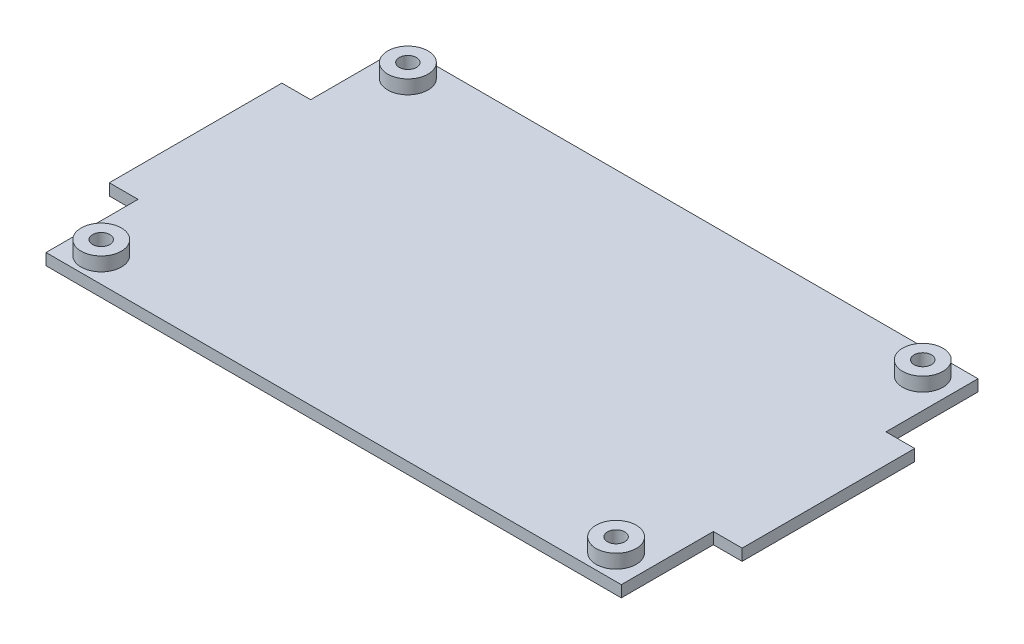
ISO-10303-21;
HEADER;
FILE_DESCRIPTION(('STEP AP214'),'2;1');
FILE_NAME('part.step','',(''),(''),'','','');
FILE_SCHEMA(('AUTOMOTIVE_DESIGN { 1 0 10303 214 1 1 1 1 }'));
ENDSEC;
DATA;
#1=APPLICATION_CONTEXT('core data for automotive mechanical design processes');
#2=APPLICATION_PROTOCOL_DEFINITION('international standard','automotive_design',2000,#1);
#3=PRODUCT_CONTEXT('',#1,'mechanical');
#4=PRODUCT('Part','Part','',(#3));
#5=PRODUCT_RELATED_PRODUCT_CATEGORY('part','',(#4));
#6=PRODUCT_DEFINITION_FORMATION('','',#4);
#7=PRODUCT_DEFINITION_CONTEXT('part definition',#1,'design');
#8=PRODUCT_DEFINITION('design','',#6,#7);
#9=PRODUCT_DEFINITION_SHAPE('','',#8);
#10=(LENGTH_UNIT() NAMED_UNIT(*) SI_UNIT(.MILLI.,.METRE.));
#11=(NAMED_UNIT(*) PLANE_ANGLE_UNIT() SI_UNIT($,.RADIAN.));
#12=(NAMED_UNIT(*) SI_UNIT($,.STERADIAN.) SOLID_ANGLE_UNIT());
#13=UNCERTAINTY_MEASURE_WITH_UNIT(LENGTH_MEASURE(1.E-05),#10,'distance_accuracy_value','');
#14=(GEOMETRIC_REPRESENTATION_CONTEXT(3) GLOBAL_UNCERTAINTY_ASSIGNED_CONTEXT((#13)) GLOBAL_UNIT_ASSIGNED_CONTEXT((#10,
#11,#12)) REPRESENTATION_CONTEXT('',''));
#15=CARTESIAN_POINT('',(0.,0.,0.));
#16=DIRECTION('',(0.,0.,1.));
#17=DIRECTION('',(1.,0.,0.));
#18=AXIS2_PLACEMENT_3D('',#15,#16,#17);
#19=CARTESIAN_POINT('',(0.,2.,0.));
#20=DIRECTION('',(0.,-1.,0.));
#21=DIRECTION('',(0.,0.,-1.));
#22=AXIS2_PLACEMENT_3D('',#19,#20,#21);
#23=PLANE('',#22);
#24=CARTESIAN_POINT('',(-44.75,2.,26.65));
#25=DIRECTION('',(0.,-1.,0.));
#26=DIRECTION('',(0.,0.,-1.));
#27=AXIS2_PLACEMENT_3D('',#24,#25,#26);
#28=CIRCLE('',#27,3.5);
#29=CARTESIAN_POINT('',(-44.75,2.,23.15));
#30=VERTEX_POINT('',#29);
#31=EDGE_CURVE('E67',#30,#30,#28,.F.);
#32=ORIENTED_EDGE('',*,*,#31,.F.);
#33=EDGE_LOOP('',(#32));
#34=FACE_BOUND('',#33,.T.);
#35=CARTESIAN_POINT('',(-44.75,2.,-26.65));
#36=DIRECTION('',(0.,-1.,0.));
#37=DIRECTION('',(0.,0.,-1.));
#38=AXIS2_PLACEMENT_3D('',#35,#36,#37);
#39=CIRCLE('',#38,3.5);
#40=CARTESIAN_POINT('',(-44.75,2.,-30.15));
#41=VERTEX_POINT('',#40);
#42=EDGE_CURVE('E161',#41,#41,#39,.F.);
#43=ORIENTED_EDGE('',*,*,#42,.F.);
#44=EDGE_LOOP('',(#43));
#45=FACE_BOUND('',#44,.T.);
#46=DIRECTION('',(1.,0.,0.));
#47=VECTOR('',#46,1.);
#48=CARTESIAN_POINT('',(-55.,2.,-15.));
#49=LINE('',#48,#47);
#50=CARTESIAN_POINT('',(50.,2.,-15.));
#51=VERTEX_POINT('',#50);
#52=CARTESIAN_POINT('',(55.,2.,-15.));
#53=VERTEX_POINT('',#52);
#54=EDGE_CURVE('E182',#51,#53,#49,.T.);
#55=ORIENTED_EDGE('',*,*,#54,.F.);
#56=DIRECTION('',(0.,0.,1.));
#57=VECTOR('',#56,1.);
#58=CARTESIAN_POINT('',(50.,2.,-31.));
#59=LINE('',#58,#57);
#60=CARTESIAN_POINT('',(50.,2.,-31.));
#61=VERTEX_POINT('',#60);
#62=EDGE_CURVE('E281',#61,#51,#59,.T.);
#63=ORIENTED_EDGE('',*,*,#62,.F.);
#64=DIRECTION('',(1.,0.,0.));
#65=VECTOR('',#64,1.);
#66=CARTESIAN_POINT('',(-50.,2.,-31.));
#67=LINE('',#66,#65);
#68=CARTESIAN_POINT('',(-50.,2.,-31.));
#69=VERTEX_POINT('',#68);
#70=EDGE_CURVE('E119',#69,#61,#67,.T.);
#71=ORIENTED_EDGE('',*,*,#70,.F.);
#72=DIRECTION('',(0.,0.,1.));
#73=VECTOR('',#72,1.);
#74=CARTESIAN_POINT('',(-50.,2.,-31.));
#75=LINE('',#74,#73);
#76=CARTESIAN_POINT('',(-50.,2.,-15.));
#77=VERTEX_POINT('',#76);
#78=EDGE_CURVE('E117',#69,#77,#75,.T.);
#79=ORIENTED_EDGE('',*,*,#78,.T.);
#80=CARTESIAN_POINT('',(-55.,2.,-15.));
#81=VERTEX_POINT('',#80);
#82=EDGE_CURVE('E320',#81,#77,#49,.T.);
#83=ORIENTED_EDGE('',*,*,#82,.F.);
#84=DIRECTION('',(0.,0.,1.));
#85=VECTOR('',#84,1.);
#86=CARTESIAN_POINT('',(-55.,2.,-15.));
#87=LINE('',#86,#85);
#88=CARTESIAN_POINT('',(-55.,2.,15.));
#89=VERTEX_POINT('',#88);
#90=EDGE_CURVE('E292',#81,#89,#87,.T.);
#91=ORIENTED_EDGE('',*,*,#90,.T.);
#92=DIRECTION('',(1.,0.,0.));
#93=VECTOR('',#92,1.);
#94=CARTESIAN_POINT('',(-55.,2.,15.));
#95=LINE('',#94,#93);
#96=CARTESIAN_POINT('',(-50.,2.,15.));
#97=VERTEX_POINT('',#96);
#98=EDGE_CURVE('E313',#89,#97,#95,.T.);
#99=ORIENTED_EDGE('',*,*,#98,.T.);
#100=CARTESIAN_POINT('',(-50.,2.,31.));
#101=VERTEX_POINT('',#100);
#102=EDGE_CURVE('E134',#97,#101,#75,.T.);
#103=ORIENTED_EDGE('',*,*,#102,.T.);
#104=DIRECTION('',(1.,0.,0.));
#105=VECTOR('',#104,1.);
#106=CARTESIAN_POINT('',(-50.,2.,31.));
#107=LINE('',#106,#105);
#108=CARTESIAN_POINT('',(50.,2.,31.));
#109=VERTEX_POINT('',#108);
#110=EDGE_CURVE('E285',#101,#109,#107,.T.);
#111=ORIENTED_EDGE('',*,*,#110,.T.);
#112=CARTESIAN_POINT('',(50.,2.,15.));
#113=VERTEX_POINT('',#112);
#114=EDGE_CURVE('E284',#113,#109,#59,.T.);
#115=ORIENTED_EDGE('',*,*,#114,.F.);
#116=CARTESIAN_POINT('',(55.,2.,15.));
#117=VERTEX_POINT('',#116);
#118=EDGE_CURVE('E316',#113,#117,#95,.T.);
#119=ORIENTED_EDGE('',*,*,#118,.T.);
#120=DIRECTION('',(0.,0.,1.));
#121=VECTOR('',#120,1.);
#122=CARTESIAN_POINT('',(55.,2.,-15.));
#123=LINE('',#122,#121);
#124=EDGE_CURVE('E317',#53,#117,#123,.T.);
#125=ORIENTED_EDGE('',*,*,#124,.F.);
#126=EDGE_LOOP('',(#55,#63,#71,#79,#83,#91,#99,#103,#111,#115,#119,#125));
#127=FACE_BOUND('',#126,.T.);
#128=CARTESIAN_POINT('',(44.75,2.,-26.65));
#129=DIRECTION('',(0.,-1.,0.));
#130=DIRECTION('',(0.,0.,-1.));
#131=AXIS2_PLACEMENT_3D('',#128,#129,#130);
#132=CIRCLE('',#131,3.5);
#133=CARTESIAN_POINT('',(44.75,2.,-30.15));
#134=VERTEX_POINT('',#133);
#135=EDGE_CURVE('E164',#134,#134,#132,.F.);
#136=ORIENTED_EDGE('',*,*,#135,.F.);
#137=EDGE_LOOP('',(#136));
#138=FACE_BOUND('',#137,.T.);
#139=CARTESIAN_POINT('',(44.75,2.,26.65));
#140=DIRECTION('',(0.,-1.,0.));
#141=DIRECTION('',(0.,0.,-1.));
#142=AXIS2_PLACEMENT_3D('',#139,#140,#141);
#143=CIRCLE('',#142,3.5);
#144=CARTESIAN_POINT('',(44.75,2.,23.15));
#145=VERTEX_POINT('',#144);
#146=EDGE_CURVE('E12',#145,#145,#143,.F.);
#147=ORIENTED_EDGE('',*,*,#146,.F.);
#148=EDGE_LOOP('',(#147));
#149=FACE_BOUND('',#148,.T.);
#150=ADVANCED_FACE('F58',(#34,#45,#127,#138,#149),#23,.F.);
#151=CARTESIAN_POINT('',(-55.,2.,15.));
#152=DIRECTION('',(0.,0.,-1.));
#153=DIRECTION('',(-1.,0.,0.));
#154=AXIS2_PLACEMENT_3D('',#151,#152,#153);
#155=PLANE('',#154);
#156=ORIENTED_EDGE('',*,*,#118,.F.);
#157=DIRECTION('',(0.,-1.,0.));
#158=VECTOR('',#157,1.);
#159=CARTESIAN_POINT('',(50.,2.,15.));
#160=LINE('',#159,#158);
#161=CARTESIAN_POINT('',(50.,0.,15.));
#162=VERTEX_POINT('',#161);
#163=EDGE_CURVE('E75',#113,#162,#160,.T.);
#164=ORIENTED_EDGE('',*,*,#163,.T.);
#165=DIRECTION('',(1.,0.,0.));
#166=VECTOR('',#165,1.);
#167=CARTESIAN_POINT('',(-55.,0.,15.));
#168=LINE('',#167,#166);
#169=CARTESIAN_POINT('',(55.,0.,15.));
#170=VERTEX_POINT('',#169);
#171=EDGE_CURVE('E306',#162,#170,#168,.T.);
#172=ORIENTED_EDGE('',*,*,#171,.T.);
#173=DIRECTION('',(0.,-1.,0.));
#174=VECTOR('',#173,1.);
#175=CARTESIAN_POINT('',(55.,2.,15.));
#176=LINE('',#175,#174);
#177=EDGE_CURVE('E291',#117,#170,#176,.T.);
#178=ORIENTED_EDGE('',*,*,#177,.F.);
#179=EDGE_LOOP('',(#156,#164,#172,#178));
#180=FACE_BOUND('',#179,.T.);
#181=ADVANCED_FACE('F173',(#180),#155,.F.);
#182=CARTESIAN_POINT('',(55.,2.,-15.));
#183=DIRECTION('',(1.,0.,0.));
#184=DIRECTION('',(0.,0.,-1.));
#185=AXIS2_PLACEMENT_3D('',#182,#183,#184);
#186=PLANE('',#185);
#187=DIRECTION('',(0.,0.,1.));
#188=VECTOR('',#187,1.);
#189=CARTESIAN_POINT('',(55.,0.,-15.));
#190=LINE('',#189,#188);
#191=CARTESIAN_POINT('',(55.,0.,-15.));
#192=VERTEX_POINT('',#191);
#193=EDGE_CURVE('E307',#192,#170,#190,.T.);
#194=ORIENTED_EDGE('',*,*,#193,.F.);
#195=DIRECTION('',(0.,-1.,0.));
#196=VECTOR('',#195,1.);
#197=CARTESIAN_POINT('',(55.,2.,-15.));
#198=LINE('',#197,#196);
#199=EDGE_CURVE('E288',#53,#192,#198,.T.);
#200=ORIENTED_EDGE('',*,*,#199,.F.);
#201=ORIENTED_EDGE('',*,*,#124,.T.);
#202=ORIENTED_EDGE('',*,*,#177,.T.);
#203=EDGE_LOOP('',(#194,#200,#201,#202));
#204=FACE_BOUND('',#203,.T.);
#205=ADVANCED_FACE('F249',(#204),#186,.T.);
#206=CARTESIAN_POINT('',(-55.,2.,-15.));
#207=DIRECTION('',(0.,0.,-1.));
#208=DIRECTION('',(-1.,0.,0.));
#209=AXIS2_PLACEMENT_3D('',#206,#207,#208);
#210=PLANE('',#209);
#211=DIRECTION('',(0.,-1.,0.));
#212=VECTOR('',#211,1.);
#213=CARTESIAN_POINT('',(50.,2.,-15.));
#214=LINE('',#213,#212);
#215=CARTESIAN_POINT('',(50.,0.,-15.));
#216=VERTEX_POINT('',#215);
#217=EDGE_CURVE('E153',#51,#216,#214,.T.);
#218=ORIENTED_EDGE('',*,*,#217,.F.);
#219=ORIENTED_EDGE('',*,*,#54,.T.);
#220=ORIENTED_EDGE('',*,*,#199,.T.);
#221=DIRECTION('',(1.,0.,0.));
#222=VECTOR('',#221,1.);
#223=CARTESIAN_POINT('',(-55.,0.,-15.));
#224=LINE('',#223,#222);
#225=EDGE_CURVE('E149',#216,#192,#224,.T.);
#226=ORIENTED_EDGE('',*,*,#225,.F.);
#227=EDGE_LOOP('',(#218,#219,#220,#226));
#228=FACE_BOUND('',#227,.T.);
#229=ADVANCED_FACE('F241',(#228),#210,.T.);
#230=CARTESIAN_POINT('',(0.,0.,0.));
#231=DIRECTION('',(0.,-1.,0.));
#232=DIRECTION('',(0.,0.,-1.));
#233=AXIS2_PLACEMENT_3D('',#230,#231,#232);
#234=PLANE('',#233);
#235=CARTESIAN_POINT('',(-44.75,0.,26.65));
#236=DIRECTION('',(0.,1.,0.));
#237=DIRECTION('',(0.,0.,1.));
#238=AXIS2_PLACEMENT_3D('',#235,#236,#237);
#239=CIRCLE('',#238,1.5);
#240=CARTESIAN_POINT('',(-44.75,0.,28.15));
#241=VERTEX_POINT('',#240);
#242=EDGE_CURVE('E326',#241,#241,#239,.T.);
#243=ORIENTED_EDGE('',*,*,#242,.T.);
#244=EDGE_LOOP('',(#243));
#245=FACE_BOUND('',#244,.T.);
#246=CARTESIAN_POINT('',(44.75,0.,26.65));
#247=DIRECTION('',(0.,1.,0.));
#248=DIRECTION('',(0.,0.,1.));
#249=AXIS2_PLACEMENT_3D('',#246,#247,#248);
#250=CIRCLE('',#249,1.5);
#251=CARTESIAN_POINT('',(44.75,0.,28.15));
#252=VERTEX_POINT('',#251);
#253=EDGE_CURVE('E330',#252,#252,#250,.T.);
#254=ORIENTED_EDGE('',*,*,#253,.T.);
#255=EDGE_LOOP('',(#254));
#256=FACE_BOUND('',#255,.T.);
#257=CARTESIAN_POINT('',(44.75,0.,-26.65));
#258=DIRECTION('',(0.,1.,0.));
#259=DIRECTION('',(0.,0.,1.));
#260=AXIS2_PLACEMENT_3D('',#257,#258,#259);
#261=CIRCLE('',#260,1.5);
#262=CARTESIAN_POINT('',(44.75,0.,-25.15));
#263=VERTEX_POINT('',#262);
#264=EDGE_CURVE('E327',#263,#263,#261,.T.);
#265=ORIENTED_EDGE('',*,*,#264,.T.);
#266=EDGE_LOOP('',(#265));
#267=FACE_BOUND('',#266,.T.);
#268=CARTESIAN_POINT('',(-44.75,0.,-26.65));
#269=DIRECTION('',(0.,1.,0.));
#270=DIRECTION('',(0.,0.,1.));
#271=AXIS2_PLACEMENT_3D('',#268,#269,#270);
#272=CIRCLE('',#271,1.5);
#273=CARTESIAN_POINT('',(-44.75,0.,-25.15));
#274=VERTEX_POINT('',#273);
#275=EDGE_CURVE('E323',#274,#274,#272,.T.);
#276=ORIENTED_EDGE('',*,*,#275,.T.);
#277=EDGE_LOOP('',(#276));
#278=FACE_BOUND('',#277,.T.);
#279=ORIENTED_EDGE('',*,*,#171,.F.);
#280=DIRECTION('',(0.,0.,1.));
#281=VECTOR('',#280,1.);
#282=CARTESIAN_POINT('',(50.,0.,-31.));
#283=LINE('',#282,#281);
#284=CARTESIAN_POINT('',(50.,0.,31.));
#285=VERTEX_POINT('',#284);
#286=EDGE_CURVE('E138',#162,#285,#283,.T.);
#287=ORIENTED_EDGE('',*,*,#286,.T.);
#288=DIRECTION('',(1.,0.,0.));
#289=VECTOR('',#288,1.);
#290=CARTESIAN_POINT('',(-50.,0.,31.));
#291=LINE('',#290,#289);
#292=CARTESIAN_POINT('',(-50.,0.,31.));
#293=VERTEX_POINT('',#292);
#294=EDGE_CURVE('E130',#293,#285,#291,.T.);
#295=ORIENTED_EDGE('',*,*,#294,.F.);
#296=DIRECTION('',(0.,0.,1.));
#297=VECTOR('',#296,1.);
#298=CARTESIAN_POINT('',(-50.,0.,-31.));
#299=LINE('',#298,#297);
#300=CARTESIAN_POINT('',(-50.,0.,15.));
#301=VERTEX_POINT('',#300);
#302=EDGE_CURVE('E131',#301,#293,#299,.T.);
#303=ORIENTED_EDGE('',*,*,#302,.F.);
#304=CARTESIAN_POINT('',(-55.,0.,15.));
#305=VERTEX_POINT('',#304);
#306=EDGE_CURVE('E303',#305,#301,#168,.T.);
#307=ORIENTED_EDGE('',*,*,#306,.F.);
#308=DIRECTION('',(0.,0.,1.));
#309=VECTOR('',#308,1.);
#310=CARTESIAN_POINT('',(-55.,0.,-15.));
#311=LINE('',#310,#309);
#312=CARTESIAN_POINT('',(-55.,0.,-15.));
#313=VERTEX_POINT('',#312);
#314=EDGE_CURVE('E300',#313,#305,#311,.T.);
#315=ORIENTED_EDGE('',*,*,#314,.F.);
#316=CARTESIAN_POINT('',(-50.,0.,-15.));
#317=VERTEX_POINT('',#316);
#318=EDGE_CURVE('E129',#313,#317,#224,.T.);
#319=ORIENTED_EDGE('',*,*,#318,.T.);
#320=CARTESIAN_POINT('',(-50.,0.,-31.));
#321=VERTEX_POINT('',#320);
#322=EDGE_CURVE('E114',#321,#317,#299,.T.);
#323=ORIENTED_EDGE('',*,*,#322,.F.);
#324=DIRECTION('',(1.,0.,0.));
#325=VECTOR('',#324,1.);
#326=CARTESIAN_POINT('',(-50.,0.,-31.));
#327=LINE('',#326,#325);
#328=CARTESIAN_POINT('',(50.,0.,-31.));
#329=VERTEX_POINT('',#328);
#330=EDGE_CURVE('E126',#321,#329,#327,.T.);
#331=ORIENTED_EDGE('',*,*,#330,.T.);
#332=EDGE_CURVE('E135',#329,#216,#283,.T.);
#333=ORIENTED_EDGE('',*,*,#332,.T.);
#334=ORIENTED_EDGE('',*,*,#225,.T.);
#335=ORIENTED_EDGE('',*,*,#193,.T.);
#336=EDGE_LOOP('',(#279,#287,#295,#303,#307,#315,#319,#323,#331,#333,#334,#335));
#337=FACE_BOUND('',#336,.T.);
#338=ADVANCED_FACE('F124',(#245,#256,#267,#278,#337),#234,.T.);
#339=CARTESIAN_POINT('',(-55.,2.,-15.));
#340=DIRECTION('',(1.,0.,0.));
#341=DIRECTION('',(0.,0.,-1.));
#342=AXIS2_PLACEMENT_3D('',#339,#340,#341);
#343=PLANE('',#342);
#344=ORIENTED_EDGE('',*,*,#314,.T.);
#345=DIRECTION('',(0.,-1.,0.));
#346=VECTOR('',#345,1.);
#347=CARTESIAN_POINT('',(-55.,2.,15.));
#348=LINE('',#347,#346);
#349=EDGE_CURVE('E295',#89,#305,#348,.T.);
#350=ORIENTED_EDGE('',*,*,#349,.F.);
#351=ORIENTED_EDGE('',*,*,#90,.F.);
#352=DIRECTION('',(0.,-1.,0.));
#353=VECTOR('',#352,1.);
#354=CARTESIAN_POINT('',(-55.,2.,-15.));
#355=LINE('',#354,#353);
#356=EDGE_CURVE('E152',#81,#313,#355,.T.);
#357=ORIENTED_EDGE('',*,*,#356,.T.);
#358=EDGE_LOOP('',(#344,#350,#351,#357));
#359=FACE_BOUND('',#358,.T.);
#360=ADVANCED_FACE('F240',(#359),#343,.F.);
#361=DIRECTION('',(0.,-1.,0.));
#362=VECTOR('',#361,1.);
#363=CARTESIAN_POINT('',(-50.,2.,15.));
#364=LINE('',#363,#362);
#365=EDGE_CURVE('E151',#97,#301,#364,.T.);
#366=ORIENTED_EDGE('',*,*,#365,.F.);
#367=ORIENTED_EDGE('',*,*,#98,.F.);
#368=ORIENTED_EDGE('',*,*,#349,.T.);
#369=ORIENTED_EDGE('',*,*,#306,.T.);
#370=EDGE_LOOP('',(#366,#367,#368,#369));
#371=FACE_BOUND('',#370,.T.);
#372=ADVANCED_FACE('F245',(#371),#155,.F.);
#373=ORIENTED_EDGE('',*,*,#82,.T.);
#374=DIRECTION('',(0.,-1.,0.));
#375=VECTOR('',#374,1.);
#376=CARTESIAN_POINT('',(-50.,2.,-15.));
#377=LINE('',#376,#375);
#378=EDGE_CURVE('E156',#77,#317,#377,.T.);
#379=ORIENTED_EDGE('',*,*,#378,.T.);
#380=ORIENTED_EDGE('',*,*,#318,.F.);
#381=ORIENTED_EDGE('',*,*,#356,.F.);
#382=EDGE_LOOP('',(#373,#379,#380,#381));
#383=FACE_BOUND('',#382,.T.);
#384=ADVANCED_FACE('F257',(#383),#210,.T.);
#385=CARTESIAN_POINT('',(-50.,2.,31.));
#386=DIRECTION('',(0.,0.,-1.));
#387=DIRECTION('',(-1.,0.,0.));
#388=AXIS2_PLACEMENT_3D('',#385,#386,#387);
#389=PLANE('',#388);
#390=ORIENTED_EDGE('',*,*,#294,.T.);
#391=DIRECTION('',(0.,-1.,0.));
#392=VECTOR('',#391,1.);
#393=CARTESIAN_POINT('',(50.,2.,31.));
#394=LINE('',#393,#392);
#395=EDGE_CURVE('E143',#109,#285,#394,.T.);
#396=ORIENTED_EDGE('',*,*,#395,.F.);
#397=ORIENTED_EDGE('',*,*,#110,.F.);
#398=DIRECTION('',(0.,-1.,0.));
#399=VECTOR('',#398,1.);
#400=CARTESIAN_POINT('',(-50.,2.,31.));
#401=LINE('',#400,#399);
#402=EDGE_CURVE('E146',#101,#293,#401,.T.);
#403=ORIENTED_EDGE('',*,*,#402,.T.);
#404=EDGE_LOOP('',(#390,#396,#397,#403));
#405=FACE_BOUND('',#404,.T.);
#406=ADVANCED_FACE('F265',(#405),#389,.F.);
#407=CARTESIAN_POINT('',(50.,2.,-31.));
#408=DIRECTION('',(1.,0.,0.));
#409=DIRECTION('',(0.,0.,-1.));
#410=AXIS2_PLACEMENT_3D('',#407,#408,#409);
#411=PLANE('',#410);
#412=ORIENTED_EDGE('',*,*,#163,.F.);
#413=ORIENTED_EDGE('',*,*,#114,.T.);
#414=ORIENTED_EDGE('',*,*,#395,.T.);
#415=ORIENTED_EDGE('',*,*,#286,.F.);
#416=EDGE_LOOP('',(#412,#413,#414,#415));
#417=FACE_BOUND('',#416,.T.);
#418=ADVANCED_FACE('F264',(#417),#411,.T.);
#419=CARTESIAN_POINT('',(-50.,2.,-31.));
#420=DIRECTION('',(1.,0.,0.));
#421=DIRECTION('',(0.,0.,-1.));
#422=AXIS2_PLACEMENT_3D('',#419,#420,#421);
#423=PLANE('',#422);
#424=ORIENTED_EDGE('',*,*,#102,.F.);
#425=ORIENTED_EDGE('',*,*,#365,.T.);
#426=ORIENTED_EDGE('',*,*,#302,.T.);
#427=ORIENTED_EDGE('',*,*,#402,.F.);
#428=EDGE_LOOP('',(#424,#425,#426,#427));
#429=FACE_BOUND('',#428,.T.);
#430=ADVANCED_FACE('F262',(#429),#423,.F.);
#431=ORIENTED_EDGE('',*,*,#62,.T.);
#432=ORIENTED_EDGE('',*,*,#217,.T.);
#433=ORIENTED_EDGE('',*,*,#332,.F.);
#434=DIRECTION('',(0.,-1.,0.));
#435=VECTOR('',#434,1.);
#436=CARTESIAN_POINT('',(50.,2.,-31.));
#437=LINE('',#436,#435);
#438=EDGE_CURVE('E104',#61,#329,#437,.T.);
#439=ORIENTED_EDGE('',*,*,#438,.F.);
#440=EDGE_LOOP('',(#431,#432,#433,#439));
#441=FACE_BOUND('',#440,.T.);
#442=ADVANCED_FACE('F260',(#441),#411,.T.);
#443=CARTESIAN_POINT('',(-50.,2.,-31.));
#444=DIRECTION('',(0.,0.,-1.));
#445=DIRECTION('',(-1.,0.,0.));
#446=AXIS2_PLACEMENT_3D('',#443,#444,#445);
#447=PLANE('',#446);
#448=ORIENTED_EDGE('',*,*,#330,.F.);
#449=DIRECTION('',(0.,-1.,0.));
#450=VECTOR('',#449,1.);
#451=CARTESIAN_POINT('',(-50.,2.,-31.));
#452=LINE('',#451,#450);
#453=EDGE_CURVE('E110',#69,#321,#452,.T.);
#454=ORIENTED_EDGE('',*,*,#453,.F.);
#455=ORIENTED_EDGE('',*,*,#70,.T.);
#456=ORIENTED_EDGE('',*,*,#438,.T.);
#457=EDGE_LOOP('',(#448,#454,#455,#456));
#458=FACE_BOUND('',#457,.T.);
#459=ADVANCED_FACE('F133',(#458),#447,.T.);
#460=ORIENTED_EDGE('',*,*,#378,.F.);
#461=ORIENTED_EDGE('',*,*,#78,.F.);
#462=ORIENTED_EDGE('',*,*,#453,.T.);
#463=ORIENTED_EDGE('',*,*,#322,.T.);
#464=EDGE_LOOP('',(#460,#461,#462,#463));
#465=FACE_BOUND('',#464,.T.);
#466=ADVANCED_FACE('F60',(#465),#423,.F.);
#467=CARTESIAN_POINT('',(-44.75,0.,-26.65));
#468=DIRECTION('',(0.,1.,0.));
#469=DIRECTION('',(0.,0.,1.));
#470=AXIS2_PLACEMENT_3D('',#467,#468,#469);
#471=CYLINDRICAL_SURFACE('',#470,1.5);
#472=ORIENTED_EDGE('',*,*,#275,.F.);
#473=EDGE_LOOP('',(#472));
#474=FACE_BOUND('',#473,.T.);
#475=CARTESIAN_POINT('',(-44.75,4.4,-26.65));
#476=DIRECTION('',(0.,1.,0.));
#477=DIRECTION('',(0.,0.,1.));
#478=AXIS2_PLACEMENT_3D('',#475,#476,#477);
#479=CIRCLE('',#478,1.5);
#480=CARTESIAN_POINT('',(-44.75,4.4,-25.15));
#481=VERTEX_POINT('',#480);
#482=EDGE_CURVE('E338',#481,#481,#479,.T.);
#483=ORIENTED_EDGE('',*,*,#482,.T.);
#484=EDGE_LOOP('',(#483));
#485=FACE_BOUND('',#484,.T.);
#486=ADVANCED_FACE('F233',(#474,#485),#471,.F.);
#487=CARTESIAN_POINT('',(44.75,0.,-26.65));
#488=DIRECTION('',(0.,1.,0.));
#489=DIRECTION('',(0.,0.,1.));
#490=AXIS2_PLACEMENT_3D('',#487,#488,#489);
#491=CYLINDRICAL_SURFACE('',#490,1.5);
#492=ORIENTED_EDGE('',*,*,#264,.F.);
#493=EDGE_LOOP('',(#492));
#494=FACE_BOUND('',#493,.T.);
#495=CARTESIAN_POINT('',(44.75,4.4,-26.65));
#496=DIRECTION('',(0.,1.,0.));
#497=DIRECTION('',(0.,0.,1.));
#498=AXIS2_PLACEMENT_3D('',#495,#496,#497);
#499=CIRCLE('',#498,1.5);
#500=CARTESIAN_POINT('',(44.75,4.4,-25.15));
#501=VERTEX_POINT('',#500);
#502=EDGE_CURVE('E344',#501,#501,#499,.T.);
#503=ORIENTED_EDGE('',*,*,#502,.T.);
#504=EDGE_LOOP('',(#503));
#505=FACE_BOUND('',#504,.T.);
#506=ADVANCED_FACE('F229',(#494,#505),#491,.F.);
#507=CARTESIAN_POINT('',(44.75,0.,26.65));
#508=DIRECTION('',(0.,1.,0.));
#509=DIRECTION('',(0.,0.,1.));
#510=AXIS2_PLACEMENT_3D('',#507,#508,#509);
#511=CYLINDRICAL_SURFACE('',#510,1.5);
#512=ORIENTED_EDGE('',*,*,#253,.F.);
#513=EDGE_LOOP('',(#512));
#514=FACE_BOUND('',#513,.T.);
#515=CARTESIAN_POINT('',(44.75,4.4,26.65));
#516=DIRECTION('',(0.,1.,0.));
#517=DIRECTION('',(0.,0.,1.));
#518=AXIS2_PLACEMENT_3D('',#515,#516,#517);
#519=CIRCLE('',#518,1.5);
#520=CARTESIAN_POINT('',(44.75,4.4,28.15));
#521=VERTEX_POINT('',#520);
#522=EDGE_CURVE('E356',#521,#521,#519,.T.);
#523=ORIENTED_EDGE('',*,*,#522,.T.);
#524=EDGE_LOOP('',(#523));
#525=FACE_BOUND('',#524,.T.);
#526=ADVANCED_FACE('F225',(#514,#525),#511,.F.);
#527=CARTESIAN_POINT('',(-44.75,0.,26.65));
#528=DIRECTION('',(0.,1.,0.));
#529=DIRECTION('',(0.,0.,1.));
#530=AXIS2_PLACEMENT_3D('',#527,#528,#529);
#531=CYLINDRICAL_SURFACE('',#530,1.5);
#532=ORIENTED_EDGE('',*,*,#242,.F.);
#533=EDGE_LOOP('',(#532));
#534=FACE_BOUND('',#533,.T.);
#535=CARTESIAN_POINT('',(-44.75,4.4,26.65));
#536=DIRECTION('',(0.,1.,0.));
#537=DIRECTION('',(0.,0.,1.));
#538=AXIS2_PLACEMENT_3D('',#535,#536,#537);
#539=CIRCLE('',#538,1.5);
#540=CARTESIAN_POINT('',(-44.75,4.4,28.15));
#541=VERTEX_POINT('',#540);
#542=EDGE_CURVE('E350',#541,#541,#539,.T.);
#543=ORIENTED_EDGE('',*,*,#542,.T.);
#544=EDGE_LOOP('',(#543));
#545=FACE_BOUND('',#544,.T.);
#546=ADVANCED_FACE('F218',(#534,#545),#531,.F.);
#547=CARTESIAN_POINT('',(-44.75,4.4,-26.65));
#548=DIRECTION('',(0.,1.,0.));
#549=DIRECTION('',(0.,0.,1.));
#550=AXIS2_PLACEMENT_3D('',#547,#548,#549);
#551=PLANE('',#550);
#552=CARTESIAN_POINT('',(-44.75,4.4,-26.65));
#553=DIRECTION('',(0.,1.,0.));
#554=DIRECTION('',(0.,0.,1.));
#555=AXIS2_PLACEMENT_3D('',#552,#553,#554);
#556=CIRCLE('',#555,3.5);
#557=CARTESIAN_POINT('',(-44.75,4.4,-23.15));
#558=VERTEX_POINT('',#557);
#559=EDGE_CURVE('E331',#558,#558,#556,.T.);
#560=ORIENTED_EDGE('',*,*,#559,.T.);
#561=EDGE_LOOP('',(#560));
#562=FACE_BOUND('',#561,.T.);
#563=ORIENTED_EDGE('',*,*,#482,.F.);
#564=EDGE_LOOP('',(#563));
#565=FACE_BOUND('',#564,.T.);
#566=ADVANCED_FACE('F215',(#562,#565),#551,.T.);
#567=CARTESIAN_POINT('',(-44.75,4.4,-26.65));
#568=DIRECTION('',(0.,-1.,0.));
#569=DIRECTION('',(0.,0.,-1.));
#570=AXIS2_PLACEMENT_3D('',#567,#568,#569);
#571=CYLINDRICAL_SURFACE('',#570,3.5);
#572=ORIENTED_EDGE('',*,*,#559,.F.);
#573=EDGE_LOOP('',(#572));
#574=FACE_BOUND('',#573,.T.);
#575=ORIENTED_EDGE('',*,*,#42,.T.);
#576=EDGE_LOOP('',(#575));
#577=FACE_BOUND('',#576,.T.);
#578=ADVANCED_FACE('F210',(#574,#577),#571,.T.);
#579=CARTESIAN_POINT('',(44.75,4.4,-26.65));
#580=DIRECTION('',(0.,1.,0.));
#581=DIRECTION('',(0.,0.,1.));
#582=AXIS2_PLACEMENT_3D('',#579,#580,#581);
#583=PLANE('',#582);
#584=CARTESIAN_POINT('',(44.75,4.4,-26.65));
#585=DIRECTION('',(0.,1.,0.));
#586=DIRECTION('',(0.,0.,1.));
#587=AXIS2_PLACEMENT_3D('',#584,#585,#586);
#588=CIRCLE('',#587,3.5);
#589=CARTESIAN_POINT('',(44.75,4.4,-23.15));
#590=VERTEX_POINT('',#589);
#591=EDGE_CURVE('E341',#590,#590,#588,.T.);
#592=ORIENTED_EDGE('',*,*,#591,.T.);
#593=EDGE_LOOP('',(#592));
#594=FACE_BOUND('',#593,.T.);
#595=ORIENTED_EDGE('',*,*,#502,.F.);
#596=EDGE_LOOP('',(#595));
#597=FACE_BOUND('',#596,.T.);
#598=ADVANCED_FACE('F207',(#594,#597),#583,.T.);
#599=CARTESIAN_POINT('',(44.75,4.4,-26.65));
#600=DIRECTION('',(0.,-1.,0.));
#601=DIRECTION('',(0.,0.,-1.));
#602=AXIS2_PLACEMENT_3D('',#599,#600,#601);
#603=CYLINDRICAL_SURFACE('',#602,3.5);
#604=ORIENTED_EDGE('',*,*,#591,.F.);
#605=EDGE_LOOP('',(#604));
#606=FACE_BOUND('',#605,.T.);
#607=ORIENTED_EDGE('',*,*,#135,.T.);
#608=EDGE_LOOP('',(#607));
#609=FACE_BOUND('',#608,.T.);
#610=ADVANCED_FACE('F202',(#606,#609),#603,.T.);
#611=CARTESIAN_POINT('',(-44.75,4.4,26.65));
#612=DIRECTION('',(0.,1.,0.));
#613=DIRECTION('',(0.,0.,1.));
#614=AXIS2_PLACEMENT_3D('',#611,#612,#613);
#615=PLANE('',#614);
#616=CARTESIAN_POINT('',(-44.75,4.4,26.65));
#617=DIRECTION('',(0.,1.,0.));
#618=DIRECTION('',(0.,0.,1.));
#619=AXIS2_PLACEMENT_3D('',#616,#617,#618);
#620=CIRCLE('',#619,3.5);
#621=CARTESIAN_POINT('',(-44.75,4.4,30.15));
#622=VERTEX_POINT('',#621);
#623=EDGE_CURVE('E347',#622,#622,#620,.T.);
#624=ORIENTED_EDGE('',*,*,#623,.T.);
#625=EDGE_LOOP('',(#624));
#626=FACE_BOUND('',#625,.T.);
#627=ORIENTED_EDGE('',*,*,#542,.F.);
#628=EDGE_LOOP('',(#627));
#629=FACE_BOUND('',#628,.T.);
#630=ADVANCED_FACE('F199',(#626,#629),#615,.T.);
#631=CARTESIAN_POINT('',(-44.75,4.4,26.65));
#632=DIRECTION('',(0.,-1.,0.));
#633=DIRECTION('',(0.,0.,-1.));
#634=AXIS2_PLACEMENT_3D('',#631,#632,#633);
#635=CYLINDRICAL_SURFACE('',#634,3.5);
#636=ORIENTED_EDGE('',*,*,#623,.F.);
#637=EDGE_LOOP('',(#636));
#638=FACE_BOUND('',#637,.T.);
#639=ORIENTED_EDGE('',*,*,#31,.T.);
#640=EDGE_LOOP('',(#639));
#641=FACE_BOUND('',#640,.T.);
#642=ADVANCED_FACE('F169',(#638,#641),#635,.T.);
#643=CARTESIAN_POINT('',(44.75,4.4,26.65));
#644=DIRECTION('',(0.,1.,0.));
#645=DIRECTION('',(0.,0.,1.));
#646=AXIS2_PLACEMENT_3D('',#643,#644,#645);
#647=PLANE('',#646);
#648=CARTESIAN_POINT('',(44.75,4.4,26.65));
#649=DIRECTION('',(0.,1.,0.));
#650=DIRECTION('',(0.,0.,1.));
#651=AXIS2_PLACEMENT_3D('',#648,#649,#650);
#652=CIRCLE('',#651,3.5);
#653=CARTESIAN_POINT('',(44.75,4.4,30.15));
#654=VERTEX_POINT('',#653);
#655=EDGE_CURVE('E353',#654,#654,#652,.T.);
#656=ORIENTED_EDGE('',*,*,#655,.T.);
#657=EDGE_LOOP('',(#656));
#658=FACE_BOUND('',#657,.T.);
#659=ORIENTED_EDGE('',*,*,#522,.F.);
#660=EDGE_LOOP('',(#659));
#661=FACE_BOUND('',#660,.T.);
#662=ADVANCED_FACE('F189',(#658,#661),#647,.T.);
#663=CARTESIAN_POINT('',(44.75,4.4,26.65));
#664=DIRECTION('',(0.,-1.,0.));
#665=DIRECTION('',(0.,0.,-1.));
#666=AXIS2_PLACEMENT_3D('',#663,#664,#665);
#667=CYLINDRICAL_SURFACE('',#666,3.5);
#668=ORIENTED_EDGE('',*,*,#655,.F.);
#669=EDGE_LOOP('',(#668));
#670=FACE_BOUND('',#669,.T.);
#671=ORIENTED_EDGE('',*,*,#146,.T.);
#672=EDGE_LOOP('',(#671));
#673=FACE_BOUND('',#672,.T.);
#674=ADVANCED_FACE('F187',(#670,#673),#667,.T.);
#675=CLOSED_SHELL('',(#150,#181,#205,#229,#338,#360,#372,#384,#406,#418,#430,#442,#459,#466,
#486,#506,#526,#546,#566,#578,#598,#610,#630,#642,#662,#674));
#676=MANIFOLD_SOLID_BREP('B2',#675);
#677=ADVANCED_BREP_SHAPE_REPRESENTATION('',(#18,#676),#14);
#678=SHAPE_DEFINITION_REPRESENTATION(#9,#677);
ENDSEC;
END-ISO-10303-21;
